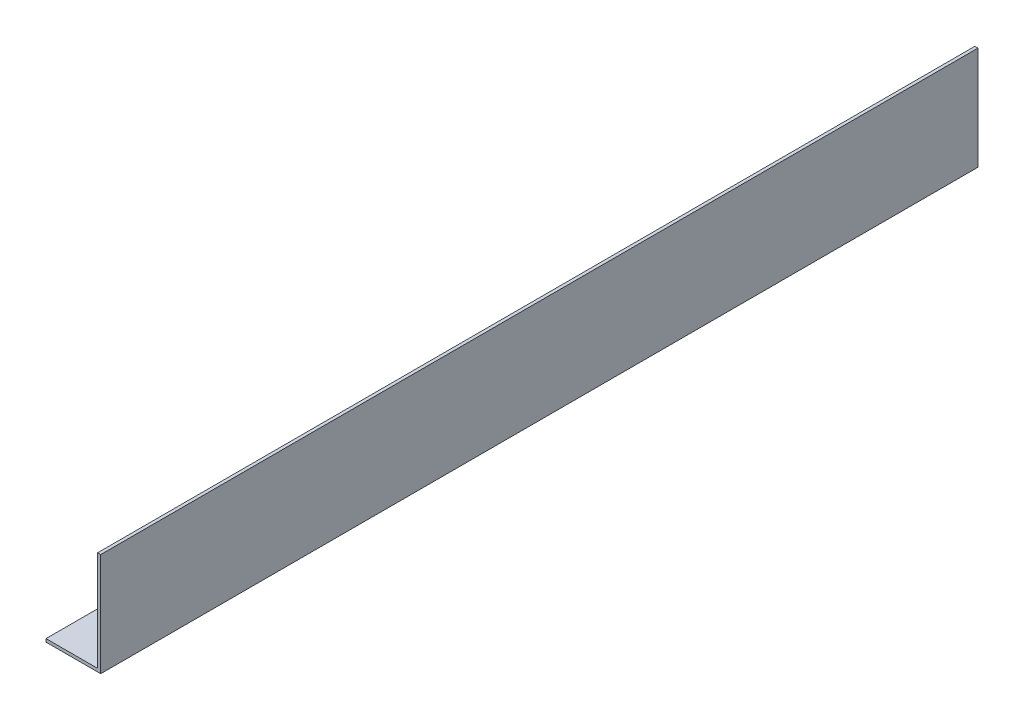
ISO-10303-21;
HEADER;
FILE_DESCRIPTION(('STEP AP214'),'2;1');
FILE_NAME('part.step','',(''),(''),'','','');
FILE_SCHEMA(('AUTOMOTIVE_DESIGN { 1 0 10303 214 1 1 1 1 }'));
ENDSEC;
DATA;
#1=APPLICATION_CONTEXT('core data for automotive mechanical design processes');
#2=APPLICATION_PROTOCOL_DEFINITION('international standard','automotive_design',2000,#1);
#3=PRODUCT_CONTEXT('',#1,'mechanical');
#4=PRODUCT('Part','Part','',(#3));
#5=PRODUCT_RELATED_PRODUCT_CATEGORY('part','',(#4));
#6=PRODUCT_DEFINITION_FORMATION('','',#4);
#7=PRODUCT_DEFINITION_CONTEXT('part definition',#1,'design');
#8=PRODUCT_DEFINITION('design','',#6,#7);
#9=PRODUCT_DEFINITION_SHAPE('','',#8);
#10=(LENGTH_UNIT() NAMED_UNIT(*) SI_UNIT(.MILLI.,.METRE.));
#11=(NAMED_UNIT(*) PLANE_ANGLE_UNIT() SI_UNIT($,.RADIAN.));
#12=(NAMED_UNIT(*) SI_UNIT($,.STERADIAN.) SOLID_ANGLE_UNIT());
#13=UNCERTAINTY_MEASURE_WITH_UNIT(LENGTH_MEASURE(1.E-05),#10,'distance_accuracy_value','');
#14=(GEOMETRIC_REPRESENTATION_CONTEXT(3) GLOBAL_UNCERTAINTY_ASSIGNED_CONTEXT((#13)) GLOBAL_UNIT_ASSIGNED_CONTEXT((#10,
#11,#12)) REPRESENTATION_CONTEXT('',''));
#15=CARTESIAN_POINT('',(0.,0.,0.));
#16=DIRECTION('',(0.,0.,1.));
#17=DIRECTION('',(1.,0.,0.));
#18=AXIS2_PLACEMENT_3D('',#15,#16,#17);
#19=CARTESIAN_POINT('',(0.,0.,431.8));
#20=DIRECTION('',(-1.,0.,0.));
#21=DIRECTION('',(0.,0.,1.));
#22=AXIS2_PLACEMENT_3D('',#19,#20,#21);
#23=PLANE('',#22);
#24=DIRECTION('',(0.,1.,0.));
#25=VECTOR('',#24,1.);
#26=CARTESIAN_POINT('',(0.,0.,0.));
#27=LINE('',#26,#25);
#28=CARTESIAN_POINT('',(0.,0.,0.));
#29=VERTEX_POINT('',#28);
#30=CARTESIAN_POINT('',(0.,50.8,0.));
#31=VERTEX_POINT('',#30);
#32=EDGE_CURVE('E117',#29,#31,#27,.T.);
#33=ORIENTED_EDGE('',*,*,#32,.T.);
#34=DIRECTION('',(0.,0.,-1.));
#35=VECTOR('',#34,1.);
#36=CARTESIAN_POINT('',(0.,50.8,431.8));
#37=LINE('',#36,#35);
#38=CARTESIAN_POINT('',(0.,50.8,431.8));
#39=VERTEX_POINT('',#38);
#40=EDGE_CURVE('E11',#39,#31,#37,.T.);
#41=ORIENTED_EDGE('',*,*,#40,.F.);
#42=DIRECTION('',(0.,1.,0.));
#43=VECTOR('',#42,1.);
#44=CARTESIAN_POINT('',(0.,0.,431.8));
#45=LINE('',#44,#43);
#46=CARTESIAN_POINT('',(0.,0.,431.8));
#47=VERTEX_POINT('',#46);
#48=EDGE_CURVE('E127',#47,#39,#45,.T.);
#49=ORIENTED_EDGE('',*,*,#48,.F.);
#50=DIRECTION('',(0.,0.,-1.));
#51=VECTOR('',#50,1.);
#52=CARTESIAN_POINT('',(0.,0.,431.8));
#53=LINE('',#52,#51);
#54=EDGE_CURVE('E113',#47,#29,#53,.T.);
#55=ORIENTED_EDGE('',*,*,#54,.T.);
#56=EDGE_LOOP('',(#33,#41,#49,#55));
#57=FACE_BOUND('',#56,.T.);
#58=ADVANCED_FACE('F33',(#57),#23,.F.);
#59=CARTESIAN_POINT('',(0.,50.8,431.8));
#60=DIRECTION('',(0.,-1.,0.));
#61=DIRECTION('',(0.,0.,-1.));
#62=AXIS2_PLACEMENT_3D('',#59,#60,#61);
#63=PLANE('',#62);
#64=DIRECTION('',(-1.,0.,0.));
#65=VECTOR('',#64,1.);
#66=CARTESIAN_POINT('',(0.,50.8,0.));
#67=LINE('',#66,#65);
#68=CARTESIAN_POINT('',(-1.524,50.8,0.));
#69=VERTEX_POINT('',#68);
#70=EDGE_CURVE('E120',#31,#69,#67,.T.);
#71=ORIENTED_EDGE('',*,*,#70,.T.);
#72=DIRECTION('',(0.,0.,-1.));
#73=VECTOR('',#72,1.);
#74=CARTESIAN_POINT('',(-1.524,50.8,431.8));
#75=LINE('',#74,#73);
#76=CARTESIAN_POINT('',(-1.524,50.8,431.8));
#77=VERTEX_POINT('',#76);
#78=EDGE_CURVE('E41',#77,#69,#75,.T.);
#79=ORIENTED_EDGE('',*,*,#78,.F.);
#80=DIRECTION('',(-1.,0.,0.));
#81=VECTOR('',#80,1.);
#82=CARTESIAN_POINT('',(0.,50.8,431.8));
#83=LINE('',#82,#81);
#84=EDGE_CURVE('E86',#39,#77,#83,.T.);
#85=ORIENTED_EDGE('',*,*,#84,.F.);
#86=ORIENTED_EDGE('',*,*,#40,.T.);
#87=EDGE_LOOP('',(#71,#79,#85,#86));
#88=FACE_BOUND('',#87,.T.);
#89=ADVANCED_FACE('F151',(#88),#63,.F.);
#90=CARTESIAN_POINT('',(-1.524,50.8,431.8));
#91=DIRECTION('',(1.,0.,0.));
#92=DIRECTION('',(0.,1.,0.));
#93=AXIS2_PLACEMENT_3D('',#90,#91,#92);
#94=PLANE('',#93);
#95=DIRECTION('',(0.,-1.,0.));
#96=VECTOR('',#95,1.);
#97=CARTESIAN_POINT('',(-1.524,50.8,0.));
#98=LINE('',#97,#96);
#99=CARTESIAN_POINT('',(-1.524,1.524,0.));
#100=VERTEX_POINT('',#99);
#101=EDGE_CURVE('E122',#69,#100,#98,.T.);
#102=ORIENTED_EDGE('',*,*,#101,.T.);
#103=DIRECTION('',(0.,0.,-1.));
#104=VECTOR('',#103,1.);
#105=CARTESIAN_POINT('',(-1.524,1.524,431.8));
#106=LINE('',#105,#104);
#107=CARTESIAN_POINT('',(-1.524,1.524,431.8));
#108=VERTEX_POINT('',#107);
#109=EDGE_CURVE('E108',#108,#100,#106,.T.);
#110=ORIENTED_EDGE('',*,*,#109,.F.);
#111=DIRECTION('',(0.,-1.,0.));
#112=VECTOR('',#111,1.);
#113=CARTESIAN_POINT('',(-1.524,50.8,431.8));
#114=LINE('',#113,#112);
#115=EDGE_CURVE('E99',#77,#108,#114,.T.);
#116=ORIENTED_EDGE('',*,*,#115,.F.);
#117=ORIENTED_EDGE('',*,*,#78,.T.);
#118=EDGE_LOOP('',(#102,#110,#116,#117));
#119=FACE_BOUND('',#118,.T.);
#120=ADVANCED_FACE('F133',(#119),#94,.F.);
#121=CARTESIAN_POINT('',(-1.524,1.524,431.8));
#122=DIRECTION('',(0.,-1.,0.));
#123=DIRECTION('',(1.,0.,0.));
#124=AXIS2_PLACEMENT_3D('',#121,#122,#123);
#125=PLANE('',#124);
#126=DIRECTION('',(-1.,0.,0.));
#127=VECTOR('',#126,1.);
#128=CARTESIAN_POINT('',(-1.524,1.524,0.));
#129=LINE('',#128,#127);
#130=CARTESIAN_POINT('',(-26.924,1.524,0.));
#131=VERTEX_POINT('',#130);
#132=EDGE_CURVE('E107',#100,#131,#129,.T.);
#133=ORIENTED_EDGE('',*,*,#132,.T.);
#134=DIRECTION('',(0.,0.,-1.));
#135=VECTOR('',#134,1.);
#136=CARTESIAN_POINT('',(-26.924,1.524,431.8));
#137=LINE('',#136,#135);
#138=CARTESIAN_POINT('',(-26.924,1.524,431.8));
#139=VERTEX_POINT('',#138);
#140=EDGE_CURVE('E104',#139,#131,#137,.T.);
#141=ORIENTED_EDGE('',*,*,#140,.F.);
#142=DIRECTION('',(-1.,0.,0.));
#143=VECTOR('',#142,1.);
#144=CARTESIAN_POINT('',(-1.524,1.524,431.8));
#145=LINE('',#144,#143);
#146=EDGE_CURVE('E93',#108,#139,#145,.T.);
#147=ORIENTED_EDGE('',*,*,#146,.F.);
#148=ORIENTED_EDGE('',*,*,#109,.T.);
#149=EDGE_LOOP('',(#133,#141,#147,#148));
#150=FACE_BOUND('',#149,.T.);
#151=ADVANCED_FACE('F105',(#150),#125,.F.);
#152=CARTESIAN_POINT('',(-26.924,1.524,431.8));
#153=DIRECTION('',(1.,0.,0.));
#154=DIRECTION('',(0.,0.,-1.));
#155=AXIS2_PLACEMENT_3D('',#152,#153,#154);
#156=PLANE('',#155);
#157=DIRECTION('',(0.,-1.,0.));
#158=VECTOR('',#157,1.);
#159=CARTESIAN_POINT('',(-26.924,1.524,0.));
#160=LINE('',#159,#158);
#161=CARTESIAN_POINT('',(-26.924,0.,0.));
#162=VERTEX_POINT('',#161);
#163=EDGE_CURVE('E72',#131,#162,#160,.T.);
#164=ORIENTED_EDGE('',*,*,#163,.T.);
#165=DIRECTION('',(0.,0.,-1.));
#166=VECTOR('',#165,1.);
#167=CARTESIAN_POINT('',(-26.924,0.,431.8));
#168=LINE('',#167,#166);
#169=CARTESIAN_POINT('',(-26.924,0.,431.8));
#170=VERTEX_POINT('',#169);
#171=EDGE_CURVE('E109',#170,#162,#168,.T.);
#172=ORIENTED_EDGE('',*,*,#171,.F.);
#173=DIRECTION('',(0.,-1.,0.));
#174=VECTOR('',#173,1.);
#175=CARTESIAN_POINT('',(-26.924,1.524,431.8));
#176=LINE('',#175,#174);
#177=EDGE_CURVE('E97',#139,#170,#176,.T.);
#178=ORIENTED_EDGE('',*,*,#177,.F.);
#179=ORIENTED_EDGE('',*,*,#140,.T.);
#180=EDGE_LOOP('',(#164,#172,#178,#179));
#181=FACE_BOUND('',#180,.T.);
#182=ADVANCED_FACE('F111',(#181),#156,.F.);
#183=CARTESIAN_POINT('',(0.,0.,431.8));
#184=DIRECTION('',(0.,1.,0.));
#185=DIRECTION('',(-1.,0.,0.));
#186=AXIS2_PLACEMENT_3D('',#183,#184,#185);
#187=PLANE('',#186);
#188=DIRECTION('',(1.,0.,0.));
#189=VECTOR('',#188,1.);
#190=CARTESIAN_POINT('',(0.,0.,0.));
#191=LINE('',#190,#189);
#192=EDGE_CURVE('E78',#162,#29,#191,.T.);
#193=ORIENTED_EDGE('',*,*,#192,.T.);
#194=ORIENTED_EDGE('',*,*,#54,.F.);
#195=DIRECTION('',(1.,0.,0.));
#196=VECTOR('',#195,1.);
#197=CARTESIAN_POINT('',(0.,0.,431.8));
#198=LINE('',#197,#196);
#199=EDGE_CURVE('E49',#170,#47,#198,.T.);
#200=ORIENTED_EDGE('',*,*,#199,.F.);
#201=ORIENTED_EDGE('',*,*,#171,.T.);
#202=EDGE_LOOP('',(#193,#194,#200,#201));
#203=FACE_BOUND('',#202,.T.);
#204=ADVANCED_FACE('F140',(#203),#187,.F.);
#205=CARTESIAN_POINT('',(0.,0.,431.8));
#206=DIRECTION('',(0.,0.,1.));
#207=DIRECTION('',(1.,0.,0.));
#208=AXIS2_PLACEMENT_3D('',#205,#206,#207);
#209=PLANE('',#208);
#210=ORIENTED_EDGE('',*,*,#48,.T.);
#211=ORIENTED_EDGE('',*,*,#84,.T.);
#212=ORIENTED_EDGE('',*,*,#115,.T.);
#213=ORIENTED_EDGE('',*,*,#146,.T.);
#214=ORIENTED_EDGE('',*,*,#177,.T.);
#215=ORIENTED_EDGE('',*,*,#199,.T.);
#216=EDGE_LOOP('',(#210,#211,#212,#213,#214,#215));
#217=FACE_BOUND('',#216,.T.);
#218=ADVANCED_FACE('F95',(#217),#209,.T.);
#219=CARTESIAN_POINT('',(0.,0.,0.));
#220=DIRECTION('',(0.,0.,1.));
#221=DIRECTION('',(1.,0.,0.));
#222=AXIS2_PLACEMENT_3D('',#219,#220,#221);
#223=PLANE('',#222);
#224=ORIENTED_EDGE('',*,*,#32,.F.);
#225=ORIENTED_EDGE('',*,*,#192,.F.);
#226=ORIENTED_EDGE('',*,*,#163,.F.);
#227=ORIENTED_EDGE('',*,*,#132,.F.);
#228=ORIENTED_EDGE('',*,*,#101,.F.);
#229=ORIENTED_EDGE('',*,*,#70,.F.);
#230=EDGE_LOOP('',(#224,#225,#226,#227,#228,#229));
#231=FACE_BOUND('',#230,.T.);
#232=ADVANCED_FACE('F136',(#231),#223,.F.);
#233=CLOSED_SHELL('',(#58,#89,#120,#151,#182,#204,#218,#232));
#234=MANIFOLD_SOLID_BREP('B2',#233);
#235=ADVANCED_BREP_SHAPE_REPRESENTATION('',(#18,#234),#14);
#236=SHAPE_DEFINITION_REPRESENTATION(#9,#235);
ENDSEC;
END-ISO-10303-21;
